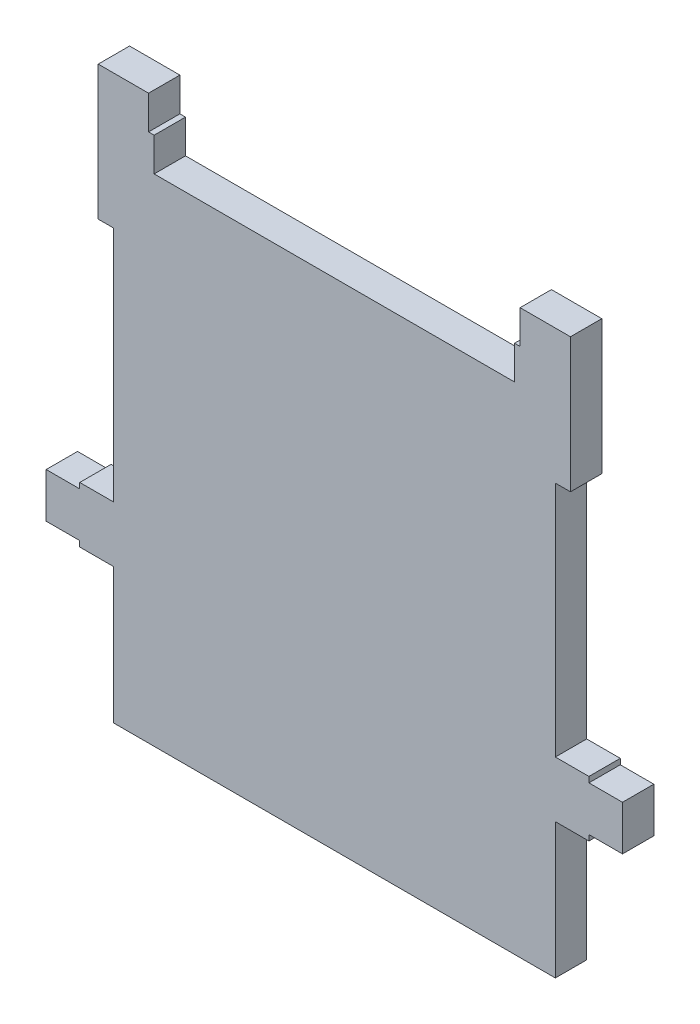
ISO-10303-21;
HEADER;
FILE_DESCRIPTION(('STEP AP214'),'2;1');
FILE_NAME('part.step','',(''),(''),'','','');
FILE_SCHEMA(('AUTOMOTIVE_DESIGN { 1 0 10303 214 1 1 1 1 }'));
ENDSEC;
DATA;
#1=APPLICATION_CONTEXT('core data for automotive mechanical design processes');
#2=APPLICATION_PROTOCOL_DEFINITION('international standard','automotive_design',2000,#1);
#3=PRODUCT_CONTEXT('',#1,'mechanical');
#4=PRODUCT('Part','Part','',(#3));
#5=PRODUCT_RELATED_PRODUCT_CATEGORY('part','',(#4));
#6=PRODUCT_DEFINITION_FORMATION('','',#4);
#7=PRODUCT_DEFINITION_CONTEXT('part definition',#1,'design');
#8=PRODUCT_DEFINITION('design','',#6,#7);
#9=PRODUCT_DEFINITION_SHAPE('','',#8);
#10=(LENGTH_UNIT() NAMED_UNIT(*) SI_UNIT(.MILLI.,.METRE.));
#11=(NAMED_UNIT(*) PLANE_ANGLE_UNIT() SI_UNIT($,.RADIAN.));
#12=(NAMED_UNIT(*) SI_UNIT($,.STERADIAN.) SOLID_ANGLE_UNIT());
#13=UNCERTAINTY_MEASURE_WITH_UNIT(LENGTH_MEASURE(1.E-05),#10,'distance_accuracy_value','');
#14=(GEOMETRIC_REPRESENTATION_CONTEXT(3) GLOBAL_UNCERTAINTY_ASSIGNED_CONTEXT((#13)) GLOBAL_UNIT_ASSIGNED_CONTEXT((#10,
#11,#12)) REPRESENTATION_CONTEXT('',''));
#15=CARTESIAN_POINT('',(0.,0.,0.));
#16=DIRECTION('',(0.,0.,1.));
#17=DIRECTION('',(1.,0.,0.));
#18=AXIS2_PLACEMENT_3D('',#15,#16,#17);
#19=CARTESIAN_POINT('',(-1.97499732,-2.51499878,0.));
#20=DIRECTION('',(0.,0.,-1.));
#21=DIRECTION('',(0.,-1.,0.));
#22=AXIS2_PLACEMENT_3D('',#19,#20,#21);
#23=PLANE('',#22);
#24=DIRECTION('',(0.,1.,0.));
#25=VECTOR('',#24,1.);
#26=CARTESIAN_POINT('',(1.97499986,-1.30499866,0.));
#27=LINE('',#26,#25);
#28=CARTESIAN_POINT('',(1.97499986,-2.51499878,0.));
#29=VERTEX_POINT('',#28);
#30=CARTESIAN_POINT('',(1.97499986,-1.30499866,0.));
#31=VERTEX_POINT('',#30);
#32=EDGE_CURVE('E282',#29,#31,#27,.T.);
#33=ORIENTED_EDGE('',*,*,#32,.F.);
#34=DIRECTION('',(1.,0.,0.));
#35=VECTOR('',#34,1.);
#36=CARTESIAN_POINT('',(1.97499986,-2.51499878,0.));
#37=LINE('',#36,#35);
#38=CARTESIAN_POINT('',(-1.97499732,-2.51499878,0.));
#39=VERTEX_POINT('',#38);
#40=EDGE_CURVE('E283',#39,#29,#37,.T.);
#41=ORIENTED_EDGE('',*,*,#40,.F.);
#42=DIRECTION('',(0.,-1.,0.));
#43=VECTOR('',#42,1.);
#44=CARTESIAN_POINT('',(-1.97499732,-2.51499878,0.));
#45=LINE('',#44,#43);
#46=CARTESIAN_POINT('',(-1.97499732,-1.30499866,0.));
#47=VERTEX_POINT('',#46);
#48=EDGE_CURVE('E11',#47,#39,#45,.T.);
#49=ORIENTED_EDGE('',*,*,#48,.F.);
#50=DIRECTION('',(1.,0.,0.));
#51=VECTOR('',#50,1.);
#52=CARTESIAN_POINT('',(-1.97499732,-1.30499866,0.));
#53=LINE('',#52,#51);
#54=CARTESIAN_POINT('',(-2.27499926,-1.30499866,0.));
#55=VERTEX_POINT('',#54);
#56=EDGE_CURVE('E20',#55,#47,#53,.T.);
#57=ORIENTED_EDGE('',*,*,#56,.F.);
#58=DIRECTION('',(0.,-1.,0.));
#59=VECTOR('',#58,1.);
#60=CARTESIAN_POINT('',(-2.27499926,-1.30499866,0.));
#61=LINE('',#60,#59);
#62=CARTESIAN_POINT('',(-2.27499926,-1.25499876,0.));
#63=VERTEX_POINT('',#62);
#64=EDGE_CURVE('E170',#63,#55,#61,.T.);
#65=ORIENTED_EDGE('',*,*,#64,.F.);
#66=DIRECTION('',(1.,0.,0.));
#67=VECTOR('',#66,1.);
#68=CARTESIAN_POINT('',(-2.27499926,-1.25499876,0.));
#69=LINE('',#68,#67);
#70=CARTESIAN_POINT('',(-2.57499866,-1.25499876,0.));
#71=VERTEX_POINT('',#70);
#72=EDGE_CURVE('E164',#71,#63,#69,.T.);
#73=ORIENTED_EDGE('',*,*,#72,.F.);
#74=DIRECTION('',(0.,-1.,0.));
#75=VECTOR('',#74,1.);
#76=CARTESIAN_POINT('',(-2.57499866,-1.25499876,0.));
#77=LINE('',#76,#75);
#78=CARTESIAN_POINT('',(-2.57499866,-0.85499956,0.));
#79=VERTEX_POINT('',#78);
#80=EDGE_CURVE('E167',#79,#71,#77,.T.);
#81=ORIENTED_EDGE('',*,*,#80,.F.);
#82=DIRECTION('',(-1.,0.,0.));
#83=VECTOR('',#82,1.);
#84=CARTESIAN_POINT('',(-2.57499866,-0.85499956,0.));
#85=LINE('',#84,#83);
#86=CARTESIAN_POINT('',(-2.27499926,-0.85499956,0.));
#87=VERTEX_POINT('',#86);
#88=EDGE_CURVE('E199',#87,#79,#85,.T.);
#89=ORIENTED_EDGE('',*,*,#88,.F.);
#90=DIRECTION('',(0.,-1.,0.));
#91=VECTOR('',#90,1.);
#92=CARTESIAN_POINT('',(-2.27499926,-0.85499956,0.));
#93=LINE('',#92,#91);
#94=CARTESIAN_POINT('',(-2.27499926,-0.80499966,0.));
#95=VERTEX_POINT('',#94);
#96=EDGE_CURVE('E245',#95,#87,#93,.T.);
#97=ORIENTED_EDGE('',*,*,#96,.F.);
#98=DIRECTION('',(-1.,0.,0.));
#99=VECTOR('',#98,1.);
#100=CARTESIAN_POINT('',(-2.27499926,-0.80499966,0.));
#101=LINE('',#100,#99);
#102=CARTESIAN_POINT('',(-1.97499732,-0.80499966,0.));
#103=VERTEX_POINT('',#102);
#104=EDGE_CURVE('E418',#103,#95,#101,.T.);
#105=ORIENTED_EDGE('',*,*,#104,.F.);
#106=DIRECTION('',(0.,-1.,0.));
#107=VECTOR('',#106,1.);
#108=CARTESIAN_POINT('',(-1.97499732,-0.80499966,0.));
#109=LINE('',#108,#107);
#110=CARTESIAN_POINT('',(-1.97499732,1.31500118,0.));
#111=VERTEX_POINT('',#110);
#112=EDGE_CURVE('E419',#111,#103,#109,.T.);
#113=ORIENTED_EDGE('',*,*,#112,.F.);
#114=DIRECTION('',(1.,0.,0.));
#115=VECTOR('',#114,1.);
#116=CARTESIAN_POINT('',(-1.97499732,1.31500118,0.));
#117=LINE('',#116,#115);
#118=CARTESIAN_POINT('',(-2.10999832,1.31500118,0.));
#119=VERTEX_POINT('',#118);
#120=EDGE_CURVE('E476',#119,#111,#117,.T.);
#121=ORIENTED_EDGE('',*,*,#120,.F.);
#122=DIRECTION('',(0.,-1.,0.));
#123=VECTOR('',#122,1.);
#124=CARTESIAN_POINT('',(-2.10999832,1.31500118,0.));
#125=LINE('',#124,#123);
#126=CARTESIAN_POINT('',(-2.10999832,2.51500132,0.));
#127=VERTEX_POINT('',#126);
#128=EDGE_CURVE('E267',#127,#119,#125,.T.);
#129=ORIENTED_EDGE('',*,*,#128,.F.);
#130=DIRECTION('',(-1.,0.,0.));
#131=VECTOR('',#130,1.);
#132=CARTESIAN_POINT('',(-2.10999832,2.51500132,0.));
#133=LINE('',#132,#131);
#134=CARTESIAN_POINT('',(-1.65999922,2.51500132,0.));
#135=VERTEX_POINT('',#134);
#136=EDGE_CURVE('E268',#135,#127,#133,.T.);
#137=ORIENTED_EDGE('',*,*,#136,.F.);
#138=DIRECTION('',(0.,1.,0.));
#139=VECTOR('',#138,1.);
#140=CARTESIAN_POINT('',(-1.65999922,2.51500132,0.));
#141=LINE('',#140,#139);
#142=CARTESIAN_POINT('',(-1.65999922,2.21500192,0.));
#143=VERTEX_POINT('',#142);
#144=EDGE_CURVE('E436',#143,#135,#141,.T.);
#145=ORIENTED_EDGE('',*,*,#144,.F.);
#146=DIRECTION('',(-1.,0.,0.));
#147=VECTOR('',#146,1.);
#148=CARTESIAN_POINT('',(-1.65999922,2.21500192,0.));
#149=LINE('',#148,#147);
#150=CARTESIAN_POINT('',(-1.60999932,2.21500192,0.));
#151=VERTEX_POINT('',#150);
#152=EDGE_CURVE('E437',#151,#143,#149,.T.);
#153=ORIENTED_EDGE('',*,*,#152,.F.);
#154=DIRECTION('',(0.,1.,0.));
#155=VECTOR('',#154,1.);
#156=CARTESIAN_POINT('',(-1.60999932,2.21500192,0.));
#157=LINE('',#156,#155);
#158=CARTESIAN_POINT('',(-1.60999932,1.91499998,0.));
#159=VERTEX_POINT('',#158);
#160=EDGE_CURVE('E420',#159,#151,#157,.T.);
#161=ORIENTED_EDGE('',*,*,#160,.F.);
#162=DIRECTION('',(-1.,0.,0.));
#163=VECTOR('',#162,1.);
#164=CARTESIAN_POINT('',(-1.60999932,1.91499998,0.));
#165=LINE('',#164,#163);
#166=CARTESIAN_POINT('',(1.61000186,1.91499998,0.));
#167=VERTEX_POINT('',#166);
#168=EDGE_CURVE('E508',#167,#159,#165,.T.);
#169=ORIENTED_EDGE('',*,*,#168,.F.);
#170=DIRECTION('',(0.,-1.,0.));
#171=VECTOR('',#170,1.);
#172=CARTESIAN_POINT('',(1.61000186,1.91499998,0.));
#173=LINE('',#172,#171);
#174=CARTESIAN_POINT('',(1.61000186,2.21500192,0.));
#175=VERTEX_POINT('',#174);
#176=EDGE_CURVE('E371',#175,#167,#173,.T.);
#177=ORIENTED_EDGE('',*,*,#176,.F.);
#178=DIRECTION('',(-1.,0.,0.));
#179=VECTOR('',#178,1.);
#180=CARTESIAN_POINT('',(1.61000186,2.21500192,0.));
#181=LINE('',#180,#179);
#182=CARTESIAN_POINT('',(1.66000176,2.21500192,0.));
#183=VERTEX_POINT('',#182);
#184=EDGE_CURVE('E231',#183,#175,#181,.T.);
#185=ORIENTED_EDGE('',*,*,#184,.F.);
#186=DIRECTION('',(0.,-1.,0.));
#187=VECTOR('',#186,1.);
#188=CARTESIAN_POINT('',(1.66000176,2.21500192,0.));
#189=LINE('',#188,#187);
#190=CARTESIAN_POINT('',(1.66000176,2.51500132,0.));
#191=VERTEX_POINT('',#190);
#192=EDGE_CURVE('E491',#191,#183,#189,.T.);
#193=ORIENTED_EDGE('',*,*,#192,.F.);
#194=DIRECTION('',(-1.,0.,0.));
#195=VECTOR('',#194,1.);
#196=CARTESIAN_POINT('',(1.66000176,2.51500132,0.));
#197=LINE('',#196,#195);
#198=CARTESIAN_POINT('',(2.11000086,2.51500132,0.));
#199=VERTEX_POINT('',#198);
#200=EDGE_CURVE('E342',#199,#191,#197,.T.);
#201=ORIENTED_EDGE('',*,*,#200,.F.);
#202=DIRECTION('',(0.,1.,0.));
#203=VECTOR('',#202,1.);
#204=CARTESIAN_POINT('',(2.11000086,2.51500132,0.));
#205=LINE('',#204,#203);
#206=CARTESIAN_POINT('',(2.11000086,1.31500118,0.));
#207=VERTEX_POINT('',#206);
#208=EDGE_CURVE('E402',#207,#199,#205,.T.);
#209=ORIENTED_EDGE('',*,*,#208,.F.);
#210=DIRECTION('',(1.,0.,0.));
#211=VECTOR('',#210,1.);
#212=CARTESIAN_POINT('',(2.11000086,1.31500118,0.));
#213=LINE('',#212,#211);
#214=CARTESIAN_POINT('',(1.97499986,1.31500118,0.));
#215=VERTEX_POINT('',#214);
#216=EDGE_CURVE('E403',#215,#207,#213,.T.);
#217=ORIENTED_EDGE('',*,*,#216,.F.);
#218=DIRECTION('',(0.,1.,0.));
#219=VECTOR('',#218,1.);
#220=CARTESIAN_POINT('',(1.97499986,1.31500118,0.));
#221=LINE('',#220,#219);
#222=CARTESIAN_POINT('',(1.97499986,-0.80499966,0.));
#223=VERTEX_POINT('',#222);
#224=EDGE_CURVE('E460',#223,#215,#221,.T.);
#225=ORIENTED_EDGE('',*,*,#224,.F.);
#226=DIRECTION('',(-1.,0.,0.));
#227=VECTOR('',#226,1.);
#228=CARTESIAN_POINT('',(1.97499986,-0.80499966,0.));
#229=LINE('',#228,#227);
#230=CARTESIAN_POINT('',(2.2750018,-0.80499966,0.));
#231=VERTEX_POINT('',#230);
#232=EDGE_CURVE('E452',#231,#223,#229,.T.);
#233=ORIENTED_EDGE('',*,*,#232,.F.);
#234=DIRECTION('',(0.,1.,0.));
#235=VECTOR('',#234,1.);
#236=CARTESIAN_POINT('',(2.2750018,-0.80499966,0.));
#237=LINE('',#236,#235);
#238=CARTESIAN_POINT('',(2.2750018,-0.85499956,0.));
#239=VERTEX_POINT('',#238);
#240=EDGE_CURVE('E444',#239,#231,#237,.T.);
#241=ORIENTED_EDGE('',*,*,#240,.F.);
#242=DIRECTION('',(-1.,0.,0.));
#243=VECTOR('',#242,1.);
#244=CARTESIAN_POINT('',(2.2750018,-0.85499956,0.));
#245=LINE('',#244,#243);
#246=CARTESIAN_POINT('',(2.5750012,-0.85499956,0.));
#247=VERTEX_POINT('',#246);
#248=EDGE_CURVE('E360',#247,#239,#245,.T.);
#249=ORIENTED_EDGE('',*,*,#248,.F.);
#250=DIRECTION('',(0.,1.,0.));
#251=VECTOR('',#250,1.);
#252=CARTESIAN_POINT('',(2.5750012,-0.85499956,0.));
#253=LINE('',#252,#251);
#254=CARTESIAN_POINT('',(2.5750012,-1.25499876,0.));
#255=VERTEX_POINT('',#254);
#256=EDGE_CURVE('E276',#255,#247,#253,.T.);
#257=ORIENTED_EDGE('',*,*,#256,.F.);
#258=DIRECTION('',(1.,0.,0.));
#259=VECTOR('',#258,1.);
#260=CARTESIAN_POINT('',(2.5750012,-1.25499876,0.));
#261=LINE('',#260,#259);
#262=CARTESIAN_POINT('',(2.2750018,-1.25499876,0.));
#263=VERTEX_POINT('',#262);
#264=EDGE_CURVE('E277',#263,#255,#261,.T.);
#265=ORIENTED_EDGE('',*,*,#264,.F.);
#266=DIRECTION('',(0.,1.,0.));
#267=VECTOR('',#266,1.);
#268=CARTESIAN_POINT('',(2.2750018,-1.25499876,0.));
#269=LINE('',#268,#267);
#270=CARTESIAN_POINT('',(2.2750018,-1.30499866,0.));
#271=VERTEX_POINT('',#270);
#272=EDGE_CURVE('E314',#271,#263,#269,.T.);
#273=ORIENTED_EDGE('',*,*,#272,.F.);
#274=DIRECTION('',(1.,0.,0.));
#275=VECTOR('',#274,1.);
#276=CARTESIAN_POINT('',(2.2750018,-1.30499866,0.));
#277=LINE('',#276,#275);
#278=EDGE_CURVE('E315',#31,#271,#277,.T.);
#279=ORIENTED_EDGE('',*,*,#278,.F.);
#280=EDGE_LOOP('',(#33,#41,#49,#57,#65,#73,#81,#89,#97,#105,#113,#121,#129,#137,#145,#153,#161,
#169,#177,#185,#193,#201,#209,#217,#225,#233,#241,#249,#257,#265,#273,#279));
#281=FACE_BOUND('',#280,.T.);
#282=ADVANCED_FACE('F17',(#281),#23,.T.);
#283=CARTESIAN_POINT('',(-1.97499732,-2.51499878,0.));
#284=DIRECTION('',(-1.,0.,0.));
#285=DIRECTION('',(0.,0.,1.));
#286=AXIS2_PLACEMENT_3D('',#283,#284,#285);
#287=PLANE('',#286);
#288=DIRECTION('',(0.,0.,1.));
#289=VECTOR('',#288,1.);
#290=CARTESIAN_POINT('',(-1.97499732,-1.30499866,0.));
#291=LINE('',#290,#289);
#292=CARTESIAN_POINT('',(-1.97499732,-1.30499866,0.27999944));
#293=VERTEX_POINT('',#292);
#294=EDGE_CURVE('E26',#47,#293,#291,.T.);
#295=ORIENTED_EDGE('',*,*,#294,.F.);
#296=ORIENTED_EDGE('',*,*,#48,.T.);
#297=DIRECTION('',(0.,0.,-1.));
#298=VECTOR('',#297,1.);
#299=CARTESIAN_POINT('',(-1.97499732,-2.51499878,0.));
#300=LINE('',#299,#298);
#301=CARTESIAN_POINT('',(-1.97499732,-2.51499878,0.27999944));
#302=VERTEX_POINT('',#301);
#303=EDGE_CURVE('E337',#302,#39,#300,.T.);
#304=ORIENTED_EDGE('',*,*,#303,.F.);
#305=DIRECTION('',(0.,1.,0.));
#306=VECTOR('',#305,1.);
#307=CARTESIAN_POINT('',(-1.97499732,-2.51499878,0.27999944));
#308=LINE('',#307,#306);
#309=EDGE_CURVE('E338',#302,#293,#308,.T.);
#310=ORIENTED_EDGE('',*,*,#309,.T.);
#311=EDGE_LOOP('',(#295,#296,#304,#310));
#312=FACE_BOUND('',#311,.T.);
#313=ADVANCED_FACE('F786',(#312),#287,.T.);
#314=CARTESIAN_POINT('',(-1.97499732,-1.30499866,0.));
#315=DIRECTION('',(0.,-1.,0.));
#316=DIRECTION('',(0.,0.,-1.));
#317=AXIS2_PLACEMENT_3D('',#314,#315,#316);
#318=PLANE('',#317);
#319=DIRECTION('',(0.,0.,1.));
#320=VECTOR('',#319,1.);
#321=CARTESIAN_POINT('',(-2.27499926,-1.30499866,0.));
#322=LINE('',#321,#320);
#323=CARTESIAN_POINT('',(-2.27499926,-1.30499866,0.27999944));
#324=VERTEX_POINT('',#323);
#325=EDGE_CURVE('E208',#55,#324,#322,.T.);
#326=ORIENTED_EDGE('',*,*,#325,.F.);
#327=ORIENTED_EDGE('',*,*,#56,.T.);
#328=ORIENTED_EDGE('',*,*,#294,.T.);
#329=DIRECTION('',(-1.,0.,0.));
#330=VECTOR('',#329,1.);
#331=CARTESIAN_POINT('',(-1.97499732,-1.30499866,0.27999944));
#332=LINE('',#331,#330);
#333=EDGE_CURVE('E381',#293,#324,#332,.T.);
#334=ORIENTED_EDGE('',*,*,#333,.T.);
#335=EDGE_LOOP('',(#326,#327,#328,#334));
#336=FACE_BOUND('',#335,.T.);
#337=ADVANCED_FACE('F797',(#336),#318,.T.);
#338=CARTESIAN_POINT('',(-2.27499926,-1.30499866,0.));
#339=DIRECTION('',(-1.,0.,0.));
#340=DIRECTION('',(0.,0.,1.));
#341=AXIS2_PLACEMENT_3D('',#338,#339,#340);
#342=PLANE('',#341);
#343=DIRECTION('',(0.,0.,1.));
#344=VECTOR('',#343,1.);
#345=CARTESIAN_POINT('',(-2.27499926,-1.25499876,0.));
#346=LINE('',#345,#344);
#347=CARTESIAN_POINT('',(-2.27499926,-1.25499876,0.27999944));
#348=VERTEX_POINT('',#347);
#349=EDGE_CURVE('E175',#63,#348,#346,.T.);
#350=ORIENTED_EDGE('',*,*,#349,.F.);
#351=ORIENTED_EDGE('',*,*,#64,.T.);
#352=ORIENTED_EDGE('',*,*,#325,.T.);
#353=DIRECTION('',(0.,1.,0.));
#354=VECTOR('',#353,1.);
#355=CARTESIAN_POINT('',(-2.27499926,-2.51499878,0.27999944));
#356=LINE('',#355,#354);
#357=EDGE_CURVE('E377',#324,#348,#356,.T.);
#358=ORIENTED_EDGE('',*,*,#357,.T.);
#359=EDGE_LOOP('',(#350,#351,#352,#358));
#360=FACE_BOUND('',#359,.T.);
#361=ADVANCED_FACE('F552',(#360),#342,.T.);
#362=CARTESIAN_POINT('',(-2.27499926,-1.25499876,0.));
#363=DIRECTION('',(0.,-1.,0.));
#364=DIRECTION('',(0.,0.,-1.));
#365=AXIS2_PLACEMENT_3D('',#362,#363,#364);
#366=PLANE('',#365);
#367=DIRECTION('',(0.,0.,1.));
#368=VECTOR('',#367,1.);
#369=CARTESIAN_POINT('',(-2.57499866,-1.25499876,0.));
#370=LINE('',#369,#368);
#371=CARTESIAN_POINT('',(-2.57499866,-1.25499876,0.27999944));
#372=VERTEX_POINT('',#371);
#373=EDGE_CURVE('E176',#71,#372,#370,.T.);
#374=ORIENTED_EDGE('',*,*,#373,.F.);
#375=ORIENTED_EDGE('',*,*,#72,.T.);
#376=ORIENTED_EDGE('',*,*,#349,.T.);
#377=DIRECTION('',(-1.,0.,0.));
#378=VECTOR('',#377,1.);
#379=CARTESIAN_POINT('',(-1.97499732,-1.25499876,0.27999944));
#380=LINE('',#379,#378);
#381=EDGE_CURVE('E183',#348,#372,#380,.T.);
#382=ORIENTED_EDGE('',*,*,#381,.T.);
#383=EDGE_LOOP('',(#374,#375,#376,#382));
#384=FACE_BOUND('',#383,.T.);
#385=ADVANCED_FACE('F180',(#384),#366,.T.);
#386=CARTESIAN_POINT('',(-2.57499866,-1.25499876,0.));
#387=DIRECTION('',(-1.,0.,0.));
#388=DIRECTION('',(0.,0.,1.));
#389=AXIS2_PLACEMENT_3D('',#386,#387,#388);
#390=PLANE('',#389);
#391=DIRECTION('',(0.,0.,1.));
#392=VECTOR('',#391,1.);
#393=CARTESIAN_POINT('',(-2.57499866,-0.85499956,0.));
#394=LINE('',#393,#392);
#395=CARTESIAN_POINT('',(-2.57499866,-0.85499956,0.27999944));
#396=VERTEX_POINT('',#395);
#397=EDGE_CURVE('E191',#79,#396,#394,.T.);
#398=ORIENTED_EDGE('',*,*,#397,.F.);
#399=ORIENTED_EDGE('',*,*,#80,.T.);
#400=ORIENTED_EDGE('',*,*,#373,.T.);
#401=DIRECTION('',(0.,1.,0.));
#402=VECTOR('',#401,1.);
#403=CARTESIAN_POINT('',(-2.57499866,-2.51499878,0.27999944));
#404=LINE('',#403,#402);
#405=EDGE_CURVE('E296',#372,#396,#404,.T.);
#406=ORIENTED_EDGE('',*,*,#405,.T.);
#407=EDGE_LOOP('',(#398,#399,#400,#406));
#408=FACE_BOUND('',#407,.T.);
#409=ADVANCED_FACE('F189',(#408),#390,.T.);
#410=CARTESIAN_POINT('',(-2.57499866,-0.85499956,0.));
#411=DIRECTION('',(0.,1.,0.));
#412=DIRECTION('',(1.,0.,0.));
#413=AXIS2_PLACEMENT_3D('',#410,#411,#412);
#414=PLANE('',#413);
#415=DIRECTION('',(0.,0.,1.));
#416=VECTOR('',#415,1.);
#417=CARTESIAN_POINT('',(-2.27499926,-0.85499956,0.));
#418=LINE('',#417,#416);
#419=CARTESIAN_POINT('',(-2.27499926,-0.85499956,0.27999944));
#420=VERTEX_POINT('',#419);
#421=EDGE_CURVE('E241',#87,#420,#418,.T.);
#422=ORIENTED_EDGE('',*,*,#421,.F.);
#423=ORIENTED_EDGE('',*,*,#88,.T.);
#424=ORIENTED_EDGE('',*,*,#397,.T.);
#425=DIRECTION('',(1.,0.,0.));
#426=VECTOR('',#425,1.);
#427=CARTESIAN_POINT('',(-1.97499732,-0.85499956,0.27999944));
#428=LINE('',#427,#426);
#429=EDGE_CURVE('E292',#396,#420,#428,.T.);
#430=ORIENTED_EDGE('',*,*,#429,.T.);
#431=EDGE_LOOP('',(#422,#423,#424,#430));
#432=FACE_BOUND('',#431,.T.);
#433=ADVANCED_FACE('F696',(#432),#414,.T.);
#434=CARTESIAN_POINT('',(-2.27499926,-0.85499956,0.));
#435=DIRECTION('',(-1.,0.,0.));
#436=DIRECTION('',(0.,0.,1.));
#437=AXIS2_PLACEMENT_3D('',#434,#435,#436);
#438=PLANE('',#437);
#439=DIRECTION('',(0.,0.,1.));
#440=VECTOR('',#439,1.);
#441=CARTESIAN_POINT('',(-2.27499926,-0.80499966,0.));
#442=LINE('',#441,#440);
#443=CARTESIAN_POINT('',(-2.27499926,-0.80499966,0.27999944));
#444=VERTEX_POINT('',#443);
#445=EDGE_CURVE('E461',#95,#444,#442,.T.);
#446=ORIENTED_EDGE('',*,*,#445,.F.);
#447=ORIENTED_EDGE('',*,*,#96,.T.);
#448=ORIENTED_EDGE('',*,*,#421,.T.);
#449=DIRECTION('',(0.,1.,0.));
#450=VECTOR('',#449,1.);
#451=CARTESIAN_POINT('',(-2.27499926,-2.51499878,0.27999944));
#452=LINE('',#451,#450);
#453=EDGE_CURVE('E297',#420,#444,#452,.T.);
#454=ORIENTED_EDGE('',*,*,#453,.T.);
#455=EDGE_LOOP('',(#446,#447,#448,#454));
#456=FACE_BOUND('',#455,.T.);
#457=ADVANCED_FACE('F691',(#456),#438,.T.);
#458=CARTESIAN_POINT('',(-2.27499926,-0.80499966,0.));
#459=DIRECTION('',(0.,1.,0.));
#460=DIRECTION('',(1.,0.,0.));
#461=AXIS2_PLACEMENT_3D('',#458,#459,#460);
#462=PLANE('',#461);
#463=DIRECTION('',(0.,0.,1.));
#464=VECTOR('',#463,1.);
#465=CARTESIAN_POINT('',(-1.97499732,-0.80499966,0.));
#466=LINE('',#465,#464);
#467=CARTESIAN_POINT('',(-1.97499732,-0.80499966,0.27999944));
#468=VERTEX_POINT('',#467);
#469=EDGE_CURVE('E414',#103,#468,#466,.T.);
#470=ORIENTED_EDGE('',*,*,#469,.F.);
#471=ORIENTED_EDGE('',*,*,#104,.T.);
#472=ORIENTED_EDGE('',*,*,#445,.T.);
#473=DIRECTION('',(1.,0.,0.));
#474=VECTOR('',#473,1.);
#475=CARTESIAN_POINT('',(-1.97499732,-0.80499966,0.27999944));
#476=LINE('',#475,#474);
#477=EDGE_CURVE('E351',#444,#468,#476,.T.);
#478=ORIENTED_EDGE('',*,*,#477,.T.);
#479=EDGE_LOOP('',(#470,#471,#472,#478));
#480=FACE_BOUND('',#479,.T.);
#481=ADVANCED_FACE('F703',(#480),#462,.T.);
#482=CARTESIAN_POINT('',(-1.97499732,-0.80499966,0.));
#483=DIRECTION('',(-1.,0.,0.));
#484=DIRECTION('',(0.,0.,1.));
#485=AXIS2_PLACEMENT_3D('',#482,#483,#484);
#486=PLANE('',#485);
#487=DIRECTION('',(0.,0.,1.));
#488=VECTOR('',#487,1.);
#489=CARTESIAN_POINT('',(-1.97499732,1.31500118,0.));
#490=LINE('',#489,#488);
#491=CARTESIAN_POINT('',(-1.97499732,1.31500118,0.27999944));
#492=VERTEX_POINT('',#491);
#493=EDGE_CURVE('E534',#111,#492,#490,.T.);
#494=ORIENTED_EDGE('',*,*,#493,.F.);
#495=ORIENTED_EDGE('',*,*,#112,.T.);
#496=ORIENTED_EDGE('',*,*,#469,.T.);
#497=DIRECTION('',(0.,1.,0.));
#498=VECTOR('',#497,1.);
#499=CARTESIAN_POINT('',(-1.97499732,-2.51499878,0.27999944));
#500=LINE('',#499,#498);
#501=EDGE_CURVE('E320',#468,#492,#500,.T.);
#502=ORIENTED_EDGE('',*,*,#501,.T.);
#503=EDGE_LOOP('',(#494,#495,#496,#502));
#504=FACE_BOUND('',#503,.T.);
#505=ADVANCED_FACE('F707',(#504),#486,.T.);
#506=CARTESIAN_POINT('',(-1.97499732,1.31500118,0.));
#507=DIRECTION('',(0.,-1.,0.));
#508=DIRECTION('',(0.,0.,-1.));
#509=AXIS2_PLACEMENT_3D('',#506,#507,#508);
#510=PLANE('',#509);
#511=DIRECTION('',(0.,0.,1.));
#512=VECTOR('',#511,1.);
#513=CARTESIAN_POINT('',(-2.10999832,1.31500118,0.));
#514=LINE('',#513,#512);
#515=CARTESIAN_POINT('',(-2.10999832,1.31500118,0.27999944));
#516=VERTEX_POINT('',#515);
#517=EDGE_CURVE('E472',#119,#516,#514,.T.);
#518=ORIENTED_EDGE('',*,*,#517,.F.);
#519=ORIENTED_EDGE('',*,*,#120,.T.);
#520=ORIENTED_EDGE('',*,*,#493,.T.);
#521=DIRECTION('',(-1.,0.,0.));
#522=VECTOR('',#521,1.);
#523=CARTESIAN_POINT('',(-1.97499732,1.31500118,0.27999944));
#524=LINE('',#523,#522);
#525=EDGE_CURVE('E316',#492,#516,#524,.T.);
#526=ORIENTED_EDGE('',*,*,#525,.T.);
#527=EDGE_LOOP('',(#518,#519,#520,#526));
#528=FACE_BOUND('',#527,.T.);
#529=ADVANCED_FACE('F709',(#528),#510,.T.);
#530=CARTESIAN_POINT('',(-2.10999832,1.31500118,0.));
#531=DIRECTION('',(-1.,0.,0.));
#532=DIRECTION('',(0.,0.,1.));
#533=AXIS2_PLACEMENT_3D('',#530,#531,#532);
#534=PLANE('',#533);
#535=DIRECTION('',(0.,0.,1.));
#536=VECTOR('',#535,1.);
#537=CARTESIAN_POINT('',(-2.10999832,2.51500132,0.));
#538=LINE('',#537,#536);
#539=CARTESIAN_POINT('',(-2.10999832,2.51500132,0.27999944));
#540=VERTEX_POINT('',#539);
#541=EDGE_CURVE('E263',#127,#540,#538,.T.);
#542=ORIENTED_EDGE('',*,*,#541,.F.);
#543=ORIENTED_EDGE('',*,*,#128,.T.);
#544=ORIENTED_EDGE('',*,*,#517,.T.);
#545=DIRECTION('',(0.,1.,0.));
#546=VECTOR('',#545,1.);
#547=CARTESIAN_POINT('',(-2.10999832,-2.51499878,0.27999944));
#548=LINE('',#547,#546);
#549=EDGE_CURVE('E321',#516,#540,#548,.T.);
#550=ORIENTED_EDGE('',*,*,#549,.T.);
#551=EDGE_LOOP('',(#542,#543,#544,#550));
#552=FACE_BOUND('',#551,.T.);
#553=ADVANCED_FACE('F713',(#552),#534,.T.);
#554=CARTESIAN_POINT('',(-2.10999832,2.51500132,0.));
#555=DIRECTION('',(0.,1.,0.));
#556=DIRECTION('',(1.,0.,0.));
#557=AXIS2_PLACEMENT_3D('',#554,#555,#556);
#558=PLANE('',#557);
#559=DIRECTION('',(0.,0.,1.));
#560=VECTOR('',#559,1.);
#561=CARTESIAN_POINT('',(-1.65999922,2.51500132,0.));
#562=LINE('',#561,#560);
#563=CARTESIAN_POINT('',(-1.65999922,2.51500132,0.27999944));
#564=VERTEX_POINT('',#563);
#565=EDGE_CURVE('E524',#135,#564,#562,.T.);
#566=ORIENTED_EDGE('',*,*,#565,.F.);
#567=ORIENTED_EDGE('',*,*,#136,.T.);
#568=ORIENTED_EDGE('',*,*,#541,.T.);
#569=DIRECTION('',(1.,0.,0.));
#570=VECTOR('',#569,1.);
#571=CARTESIAN_POINT('',(-1.97499732,2.51500132,0.27999944));
#572=LINE('',#571,#570);
#573=EDGE_CURVE('E329',#540,#564,#572,.T.);
#574=ORIENTED_EDGE('',*,*,#573,.T.);
#575=EDGE_LOOP('',(#566,#567,#568,#574));
#576=FACE_BOUND('',#575,.T.);
#577=ADVANCED_FACE('F717',(#576),#558,.T.);
#578=CARTESIAN_POINT('',(-1.65999922,2.51500132,0.));
#579=DIRECTION('',(1.,0.,0.));
#580=DIRECTION('',(0.,1.,0.));
#581=AXIS2_PLACEMENT_3D('',#578,#579,#580);
#582=PLANE('',#581);
#583=DIRECTION('',(0.,0.,1.));
#584=VECTOR('',#583,1.);
#585=CARTESIAN_POINT('',(-1.65999922,2.21500192,0.));
#586=LINE('',#585,#584);
#587=CARTESIAN_POINT('',(-1.65999922,2.21500192,0.27999944));
#588=VERTEX_POINT('',#587);
#589=EDGE_CURVE('E432',#143,#588,#586,.T.);
#590=ORIENTED_EDGE('',*,*,#589,.F.);
#591=ORIENTED_EDGE('',*,*,#144,.T.);
#592=ORIENTED_EDGE('',*,*,#565,.T.);
#593=DIRECTION('',(0.,-1.,0.));
#594=VECTOR('',#593,1.);
#595=CARTESIAN_POINT('',(-1.65999922,-2.51499878,0.27999944));
#596=LINE('',#595,#594);
#597=EDGE_CURVE('E325',#564,#588,#596,.T.);
#598=ORIENTED_EDGE('',*,*,#597,.T.);
#599=EDGE_LOOP('',(#590,#591,#592,#598));
#600=FACE_BOUND('',#599,.T.);
#601=ADVANCED_FACE('F721',(#600),#582,.T.);
#602=CARTESIAN_POINT('',(-1.65999922,2.21500192,0.));
#603=DIRECTION('',(0.,1.,0.));
#604=DIRECTION('',(1.,0.,0.));
#605=AXIS2_PLACEMENT_3D('',#602,#603,#604);
#606=PLANE('',#605);
#607=DIRECTION('',(0.,0.,1.));
#608=VECTOR('',#607,1.);
#609=CARTESIAN_POINT('',(-1.60999932,2.21500192,0.));
#610=LINE('',#609,#608);
#611=CARTESIAN_POINT('',(-1.60999932,2.21500192,0.27999944));
#612=VERTEX_POINT('',#611);
#613=EDGE_CURVE('E424',#151,#612,#610,.T.);
#614=ORIENTED_EDGE('',*,*,#613,.F.);
#615=ORIENTED_EDGE('',*,*,#152,.T.);
#616=ORIENTED_EDGE('',*,*,#589,.T.);
#617=DIRECTION('',(1.,0.,0.));
#618=VECTOR('',#617,1.);
#619=CARTESIAN_POINT('',(-1.97499732,2.21500192,0.27999944));
#620=LINE('',#619,#618);
#621=EDGE_CURVE('E309',#588,#612,#620,.T.);
#622=ORIENTED_EDGE('',*,*,#621,.T.);
#623=EDGE_LOOP('',(#614,#615,#616,#622));
#624=FACE_BOUND('',#623,.T.);
#625=ADVANCED_FACE('F725',(#624),#606,.T.);
#626=CARTESIAN_POINT('',(-1.60999932,2.21500192,0.));
#627=DIRECTION('',(1.,0.,0.));
#628=DIRECTION('',(0.,1.,0.));
#629=AXIS2_PLACEMENT_3D('',#626,#627,#628);
#630=PLANE('',#629);
#631=DIRECTION('',(0.,0.,1.));
#632=VECTOR('',#631,1.);
#633=CARTESIAN_POINT('',(-1.60999932,1.91499998,0.));
#634=LINE('',#633,#632);
#635=CARTESIAN_POINT('',(-1.60999932,1.91499998,0.27999944));
#636=VERTEX_POINT('',#635);
#637=EDGE_CURVE('E425',#159,#636,#634,.T.);
#638=ORIENTED_EDGE('',*,*,#637,.F.);
#639=ORIENTED_EDGE('',*,*,#160,.T.);
#640=ORIENTED_EDGE('',*,*,#613,.T.);
#641=DIRECTION('',(0.,-1.,0.));
#642=VECTOR('',#641,1.);
#643=CARTESIAN_POINT('',(-1.60999932,-2.51499878,0.27999944));
#644=LINE('',#643,#642);
#645=EDGE_CURVE('E305',#612,#636,#644,.T.);
#646=ORIENTED_EDGE('',*,*,#645,.T.);
#647=EDGE_LOOP('',(#638,#639,#640,#646));
#648=FACE_BOUND('',#647,.T.);
#649=ADVANCED_FACE('F729',(#648),#630,.T.);
#650=CARTESIAN_POINT('',(-1.60999932,1.91499998,0.));
#651=DIRECTION('',(0.,1.,0.));
#652=DIRECTION('',(1.,0.,0.));
#653=AXIS2_PLACEMENT_3D('',#650,#651,#652);
#654=PLANE('',#653);
#655=DIRECTION('',(0.,0.,1.));
#656=VECTOR('',#655,1.);
#657=CARTESIAN_POINT('',(1.61000186,1.91499998,0.));
#658=LINE('',#657,#656);
#659=CARTESIAN_POINT('',(1.61000186,1.91499998,0.27999944));
#660=VERTEX_POINT('',#659);
#661=EDGE_CURVE('E504',#167,#660,#658,.T.);
#662=ORIENTED_EDGE('',*,*,#661,.F.);
#663=ORIENTED_EDGE('',*,*,#168,.T.);
#664=ORIENTED_EDGE('',*,*,#637,.T.);
#665=DIRECTION('',(1.,0.,0.));
#666=VECTOR('',#665,1.);
#667=CARTESIAN_POINT('',(-1.97499732,1.91499998,0.27999944));
#668=LINE('',#667,#666);
#669=EDGE_CURVE('E300',#636,#660,#668,.T.);
#670=ORIENTED_EDGE('',*,*,#669,.T.);
#671=EDGE_LOOP('',(#662,#663,#664,#670));
#672=FACE_BOUND('',#671,.T.);
#673=ADVANCED_FACE('F733',(#672),#654,.T.);
#674=CARTESIAN_POINT('',(1.61000186,1.91499998,0.));
#675=DIRECTION('',(-1.,0.,0.));
#676=DIRECTION('',(0.,0.,1.));
#677=AXIS2_PLACEMENT_3D('',#674,#675,#676);
#678=PLANE('',#677);
#679=DIRECTION('',(0.,0.,1.));
#680=VECTOR('',#679,1.);
#681=CARTESIAN_POINT('',(1.61000186,2.21500192,0.));
#682=LINE('',#681,#680);
#683=CARTESIAN_POINT('',(1.61000186,2.21500192,0.27999944));
#684=VERTEX_POINT('',#683);
#685=EDGE_CURVE('E235',#175,#684,#682,.T.);
#686=ORIENTED_EDGE('',*,*,#685,.F.);
#687=ORIENTED_EDGE('',*,*,#176,.T.);
#688=ORIENTED_EDGE('',*,*,#661,.T.);
#689=DIRECTION('',(0.,1.,0.));
#690=VECTOR('',#689,1.);
#691=CARTESIAN_POINT('',(1.61000186,-2.51499878,0.27999944));
#692=LINE('',#691,#690);
#693=EDGE_CURVE('E288',#660,#684,#692,.T.);
#694=ORIENTED_EDGE('',*,*,#693,.T.);
#695=EDGE_LOOP('',(#686,#687,#688,#694));
#696=FACE_BOUND('',#695,.T.);
#697=ADVANCED_FACE('F737',(#696),#678,.T.);
#698=CARTESIAN_POINT('',(1.61000186,2.21500192,0.));
#699=DIRECTION('',(0.,1.,0.));
#700=DIRECTION('',(1.,0.,0.));
#701=AXIS2_PLACEMENT_3D('',#698,#699,#700);
#702=PLANE('',#701);
#703=DIRECTION('',(0.,0.,1.));
#704=VECTOR('',#703,1.);
#705=CARTESIAN_POINT('',(1.66000176,2.21500192,0.));
#706=LINE('',#705,#704);
#707=CARTESIAN_POINT('',(1.66000176,2.21500192,0.27999944));
#708=VERTEX_POINT('',#707);
#709=EDGE_CURVE('E236',#183,#708,#706,.T.);
#710=ORIENTED_EDGE('',*,*,#709,.F.);
#711=ORIENTED_EDGE('',*,*,#184,.T.);
#712=ORIENTED_EDGE('',*,*,#685,.T.);
#713=DIRECTION('',(1.,0.,0.));
#714=VECTOR('',#713,1.);
#715=CARTESIAN_POINT('',(-1.97499732,2.21500192,0.27999944));
#716=LINE('',#715,#714);
#717=EDGE_CURVE('E284',#684,#708,#716,.T.);
#718=ORIENTED_EDGE('',*,*,#717,.T.);
#719=EDGE_LOOP('',(#710,#711,#712,#718));
#720=FACE_BOUND('',#719,.T.);
#721=ADVANCED_FACE('F741',(#720),#702,.T.);
#722=CARTESIAN_POINT('',(1.66000176,2.21500192,0.));
#723=DIRECTION('',(-1.,0.,0.));
#724=DIRECTION('',(0.,0.,1.));
#725=AXIS2_PLACEMENT_3D('',#722,#723,#724);
#726=PLANE('',#725);
#727=DIRECTION('',(0.,0.,1.));
#728=VECTOR('',#727,1.);
#729=CARTESIAN_POINT('',(1.66000176,2.51500132,0.));
#730=LINE('',#729,#728);
#731=CARTESIAN_POINT('',(1.66000176,2.51500132,0.27999944));
#732=VERTEX_POINT('',#731);
#733=EDGE_CURVE('E346',#191,#732,#730,.T.);
#734=ORIENTED_EDGE('',*,*,#733,.F.);
#735=ORIENTED_EDGE('',*,*,#192,.T.);
#736=ORIENTED_EDGE('',*,*,#709,.T.);
#737=DIRECTION('',(0.,1.,0.));
#738=VECTOR('',#737,1.);
#739=CARTESIAN_POINT('',(1.66000176,-2.51499878,0.27999944));
#740=LINE('',#739,#738);
#741=EDGE_CURVE('E259',#708,#732,#740,.T.);
#742=ORIENTED_EDGE('',*,*,#741,.T.);
#743=EDGE_LOOP('',(#734,#735,#736,#742));
#744=FACE_BOUND('',#743,.T.);
#745=ADVANCED_FACE('F745',(#744),#726,.T.);
#746=CARTESIAN_POINT('',(1.66000176,2.51500132,0.));
#747=DIRECTION('',(0.,1.,0.));
#748=DIRECTION('',(1.,0.,0.));
#749=AXIS2_PLACEMENT_3D('',#746,#747,#748);
#750=PLANE('',#749);
#751=DIRECTION('',(0.,0.,1.));
#752=VECTOR('',#751,1.);
#753=CARTESIAN_POINT('',(2.11000086,2.51500132,0.));
#754=LINE('',#753,#752);
#755=CARTESIAN_POINT('',(2.11000086,2.51500132,0.27999944));
#756=VERTEX_POINT('',#755);
#757=EDGE_CURVE('E347',#199,#756,#754,.T.);
#758=ORIENTED_EDGE('',*,*,#757,.F.);
#759=ORIENTED_EDGE('',*,*,#200,.T.);
#760=ORIENTED_EDGE('',*,*,#733,.T.);
#761=DIRECTION('',(1.,0.,0.));
#762=VECTOR('',#761,1.);
#763=CARTESIAN_POINT('',(-1.97499732,2.51500132,0.27999944));
#764=LINE('',#763,#762);
#765=EDGE_CURVE('E255',#732,#756,#764,.T.);
#766=ORIENTED_EDGE('',*,*,#765,.T.);
#767=EDGE_LOOP('',(#758,#759,#760,#766));
#768=FACE_BOUND('',#767,.T.);
#769=ADVANCED_FACE('F749',(#768),#750,.T.);
#770=CARTESIAN_POINT('',(2.11000086,2.51500132,0.));
#771=DIRECTION('',(1.,0.,0.));
#772=DIRECTION('',(0.,1.,0.));
#773=AXIS2_PLACEMENT_3D('',#770,#771,#772);
#774=PLANE('',#773);
#775=DIRECTION('',(0.,0.,1.));
#776=VECTOR('',#775,1.);
#777=CARTESIAN_POINT('',(2.11000086,1.31500118,0.));
#778=LINE('',#777,#776);
#779=CARTESIAN_POINT('',(2.11000086,1.31500118,0.27999944));
#780=VERTEX_POINT('',#779);
#781=EDGE_CURVE('E398',#207,#780,#778,.T.);
#782=ORIENTED_EDGE('',*,*,#781,.F.);
#783=ORIENTED_EDGE('',*,*,#208,.T.);
#784=ORIENTED_EDGE('',*,*,#757,.T.);
#785=DIRECTION('',(0.,-1.,0.));
#786=VECTOR('',#785,1.);
#787=CARTESIAN_POINT('',(2.11000086,-2.51499878,0.27999944));
#788=LINE('',#787,#786);
#789=EDGE_CURVE('E250',#756,#780,#788,.T.);
#790=ORIENTED_EDGE('',*,*,#789,.T.);
#791=EDGE_LOOP('',(#782,#783,#784,#790));
#792=FACE_BOUND('',#791,.T.);
#793=ADVANCED_FACE('F753',(#792),#774,.T.);
#794=CARTESIAN_POINT('',(2.11000086,1.31500118,0.));
#795=DIRECTION('',(0.,-1.,0.));
#796=DIRECTION('',(0.,0.,-1.));
#797=AXIS2_PLACEMENT_3D('',#794,#795,#796);
#798=PLANE('',#797);
#799=DIRECTION('',(0.,0.,1.));
#800=VECTOR('',#799,1.);
#801=CARTESIAN_POINT('',(1.97499986,1.31500118,0.));
#802=LINE('',#801,#800);
#803=CARTESIAN_POINT('',(1.97499986,1.31500118,0.27999944));
#804=VERTEX_POINT('',#803);
#805=EDGE_CURVE('E468',#215,#804,#802,.T.);
#806=ORIENTED_EDGE('',*,*,#805,.F.);
#807=ORIENTED_EDGE('',*,*,#216,.T.);
#808=ORIENTED_EDGE('',*,*,#781,.T.);
#809=DIRECTION('',(-1.,0.,0.));
#810=VECTOR('',#809,1.);
#811=CARTESIAN_POINT('',(-1.97499732,1.31500118,0.27999944));
#812=LINE('',#811,#810);
#813=EDGE_CURVE('E246',#780,#804,#812,.T.);
#814=ORIENTED_EDGE('',*,*,#813,.T.);
#815=EDGE_LOOP('',(#806,#807,#808,#814));
#816=FACE_BOUND('',#815,.T.);
#817=ADVANCED_FACE('F757',(#816),#798,.T.);
#818=CARTESIAN_POINT('',(1.97499986,1.31500118,0.));
#819=DIRECTION('',(1.,0.,0.));
#820=DIRECTION('',(0.,1.,0.));
#821=AXIS2_PLACEMENT_3D('',#818,#819,#820);
#822=PLANE('',#821);
#823=DIRECTION('',(0.,0.,1.));
#824=VECTOR('',#823,1.);
#825=CARTESIAN_POINT('',(1.97499986,-0.80499966,0.));
#826=LINE('',#825,#824);
#827=CARTESIAN_POINT('',(1.97499986,-0.80499966,0.27999944));
#828=VERTEX_POINT('',#827);
#829=EDGE_CURVE('E456',#223,#828,#826,.T.);
#830=ORIENTED_EDGE('',*,*,#829,.F.);
#831=ORIENTED_EDGE('',*,*,#224,.T.);
#832=ORIENTED_EDGE('',*,*,#805,.T.);
#833=DIRECTION('',(0.,-1.,0.));
#834=VECTOR('',#833,1.);
#835=CARTESIAN_POINT('',(1.97499986,-2.51499878,0.27999944));
#836=LINE('',#835,#834);
#837=EDGE_CURVE('E251',#804,#828,#836,.T.);
#838=ORIENTED_EDGE('',*,*,#837,.T.);
#839=EDGE_LOOP('',(#830,#831,#832,#838));
#840=FACE_BOUND('',#839,.T.);
#841=ADVANCED_FACE('F761',(#840),#822,.T.);
#842=CARTESIAN_POINT('',(1.97499986,-0.80499966,0.));
#843=DIRECTION('',(0.,1.,0.));
#844=DIRECTION('',(1.,0.,0.));
#845=AXIS2_PLACEMENT_3D('',#842,#843,#844);
#846=PLANE('',#845);
#847=DIRECTION('',(0.,0.,1.));
#848=VECTOR('',#847,1.);
#849=CARTESIAN_POINT('',(2.2750018,-0.80499966,0.));
#850=LINE('',#849,#848);
#851=CARTESIAN_POINT('',(2.2750018,-0.80499966,0.27999944));
#852=VERTEX_POINT('',#851);
#853=EDGE_CURVE('E448',#231,#852,#850,.T.);
#854=ORIENTED_EDGE('',*,*,#853,.F.);
#855=ORIENTED_EDGE('',*,*,#232,.T.);
#856=ORIENTED_EDGE('',*,*,#829,.T.);
#857=DIRECTION('',(1.,0.,0.));
#858=VECTOR('',#857,1.);
#859=CARTESIAN_POINT('',(-1.97499732,-0.80499966,0.27999944));
#860=LINE('',#859,#858);
#861=EDGE_CURVE('E240',#828,#852,#860,.T.);
#862=ORIENTED_EDGE('',*,*,#861,.T.);
#863=EDGE_LOOP('',(#854,#855,#856,#862));
#864=FACE_BOUND('',#863,.T.);
#865=ADVANCED_FACE('F765',(#864),#846,.T.);
#866=CARTESIAN_POINT('',(2.2750018,-0.80499966,0.));
#867=DIRECTION('',(1.,0.,0.));
#868=DIRECTION('',(0.,1.,0.));
#869=AXIS2_PLACEMENT_3D('',#866,#867,#868);
#870=PLANE('',#869);
#871=DIRECTION('',(0.,0.,1.));
#872=VECTOR('',#871,1.);
#873=CARTESIAN_POINT('',(2.2750018,-0.85499956,0.));
#874=LINE('',#873,#872);
#875=CARTESIAN_POINT('',(2.2750018,-0.85499956,0.27999944));
#876=VERTEX_POINT('',#875);
#877=EDGE_CURVE('E364',#239,#876,#874,.T.);
#878=ORIENTED_EDGE('',*,*,#877,.F.);
#879=ORIENTED_EDGE('',*,*,#240,.T.);
#880=ORIENTED_EDGE('',*,*,#853,.T.);
#881=DIRECTION('',(0.,-1.,0.));
#882=VECTOR('',#881,1.);
#883=CARTESIAN_POINT('',(2.2750018,-2.51499878,0.27999944));
#884=LINE('',#883,#882);
#885=EDGE_CURVE('E206',#852,#876,#884,.T.);
#886=ORIENTED_EDGE('',*,*,#885,.T.);
#887=EDGE_LOOP('',(#878,#879,#880,#886));
#888=FACE_BOUND('',#887,.T.);
#889=ADVANCED_FACE('F769',(#888),#870,.T.);
#890=CARTESIAN_POINT('',(2.2750018,-0.85499956,0.));
#891=DIRECTION('',(0.,1.,0.));
#892=DIRECTION('',(1.,0.,0.));
#893=AXIS2_PLACEMENT_3D('',#890,#891,#892);
#894=PLANE('',#893);
#895=DIRECTION('',(0.,0.,1.));
#896=VECTOR('',#895,1.);
#897=CARTESIAN_POINT('',(2.5750012,-0.85499956,0.));
#898=LINE('',#897,#896);
#899=CARTESIAN_POINT('',(2.5750012,-0.85499956,0.27999944));
#900=VERTEX_POINT('',#899);
#901=EDGE_CURVE('E365',#247,#900,#898,.T.);
#902=ORIENTED_EDGE('',*,*,#901,.F.);
#903=ORIENTED_EDGE('',*,*,#248,.T.);
#904=ORIENTED_EDGE('',*,*,#877,.T.);
#905=DIRECTION('',(1.,0.,0.));
#906=VECTOR('',#905,1.);
#907=CARTESIAN_POINT('',(-1.97499732,-0.85499956,0.27999944));
#908=LINE('',#907,#906);
#909=EDGE_CURVE('E202',#876,#900,#908,.T.);
#910=ORIENTED_EDGE('',*,*,#909,.T.);
#911=EDGE_LOOP('',(#902,#903,#904,#910));
#912=FACE_BOUND('',#911,.T.);
#913=ADVANCED_FACE('F772',(#912),#894,.T.);
#914=CARTESIAN_POINT('',(2.5750012,-0.85499956,0.));
#915=DIRECTION('',(1.,0.,0.));
#916=DIRECTION('',(0.,1.,0.));
#917=AXIS2_PLACEMENT_3D('',#914,#915,#916);
#918=PLANE('',#917);
#919=DIRECTION('',(0.,0.,1.));
#920=VECTOR('',#919,1.);
#921=CARTESIAN_POINT('',(2.5750012,-1.25499876,0.));
#922=LINE('',#921,#920);
#923=CARTESIAN_POINT('',(2.5750012,-1.25499876,0.27999944));
#924=VERTEX_POINT('',#923);
#925=EDGE_CURVE('E272',#255,#924,#922,.T.);
#926=ORIENTED_EDGE('',*,*,#925,.F.);
#927=ORIENTED_EDGE('',*,*,#256,.T.);
#928=ORIENTED_EDGE('',*,*,#901,.T.);
#929=DIRECTION('',(0.,-1.,0.));
#930=VECTOR('',#929,1.);
#931=CARTESIAN_POINT('',(2.5750012,-2.51499878,0.27999944));
#932=LINE('',#931,#930);
#933=EDGE_CURVE('E207',#900,#924,#932,.T.);
#934=ORIENTED_EDGE('',*,*,#933,.T.);
#935=EDGE_LOOP('',(#926,#927,#928,#934));
#936=FACE_BOUND('',#935,.T.);
#937=ADVANCED_FACE('F573',(#936),#918,.T.);
#938=CARTESIAN_POINT('',(2.5750012,-1.25499876,0.));
#939=DIRECTION('',(0.,-1.,0.));
#940=DIRECTION('',(0.,0.,-1.));
#941=AXIS2_PLACEMENT_3D('',#938,#939,#940);
#942=PLANE('',#941);
#943=DIRECTION('',(0.,0.,1.));
#944=VECTOR('',#943,1.);
#945=CARTESIAN_POINT('',(2.2750018,-1.25499876,0.));
#946=LINE('',#945,#944);
#947=CARTESIAN_POINT('',(2.2750018,-1.25499876,0.27999944));
#948=VERTEX_POINT('',#947);
#949=EDGE_CURVE('E410',#263,#948,#946,.T.);
#950=ORIENTED_EDGE('',*,*,#949,.F.);
#951=ORIENTED_EDGE('',*,*,#264,.T.);
#952=ORIENTED_EDGE('',*,*,#925,.T.);
#953=DIRECTION('',(-1.,0.,0.));
#954=VECTOR('',#953,1.);
#955=CARTESIAN_POINT('',(-1.97499732,-1.25499876,0.27999944));
#956=LINE('',#955,#954);
#957=EDGE_CURVE('E216',#924,#948,#956,.T.);
#958=ORIENTED_EDGE('',*,*,#957,.T.);
#959=EDGE_LOOP('',(#950,#951,#952,#958));
#960=FACE_BOUND('',#959,.T.);
#961=ADVANCED_FACE('F578',(#960),#942,.T.);
#962=CARTESIAN_POINT('',(2.2750018,-1.25499876,0.));
#963=DIRECTION('',(1.,0.,0.));
#964=DIRECTION('',(0.,1.,0.));
#965=AXIS2_PLACEMENT_3D('',#962,#963,#964);
#966=PLANE('',#965);
#967=DIRECTION('',(0.,0.,1.));
#968=VECTOR('',#967,1.);
#969=CARTESIAN_POINT('',(2.2750018,-1.30499866,0.));
#970=LINE('',#969,#968);
#971=CARTESIAN_POINT('',(2.2750018,-1.30499866,0.27999944));
#972=VERTEX_POINT('',#971);
#973=EDGE_CURVE('E310',#271,#972,#970,.T.);
#974=ORIENTED_EDGE('',*,*,#973,.F.);
#975=ORIENTED_EDGE('',*,*,#272,.T.);
#976=ORIENTED_EDGE('',*,*,#949,.T.);
#977=DIRECTION('',(0.,-1.,0.));
#978=VECTOR('',#977,1.);
#979=CARTESIAN_POINT('',(2.2750018,-2.51499878,0.27999944));
#980=LINE('',#979,#978);
#981=EDGE_CURVE('E212',#948,#972,#980,.T.);
#982=ORIENTED_EDGE('',*,*,#981,.T.);
#983=EDGE_LOOP('',(#974,#975,#976,#982));
#984=FACE_BOUND('',#983,.T.);
#985=ADVANCED_FACE('F583',(#984),#966,.T.);
#986=CARTESIAN_POINT('',(2.2750018,-1.30499866,0.));
#987=DIRECTION('',(0.,-1.,0.));
#988=DIRECTION('',(0.,0.,-1.));
#989=AXIS2_PLACEMENT_3D('',#986,#987,#988);
#990=PLANE('',#989);
#991=DIRECTION('',(0.,0.,1.));
#992=VECTOR('',#991,1.);
#993=CARTESIAN_POINT('',(1.97499986,-1.30499866,0.));
#994=LINE('',#993,#992);
#995=CARTESIAN_POINT('',(1.97499986,-1.30499866,0.27999944));
#996=VERTEX_POINT('',#995);
#997=EDGE_CURVE('E394',#31,#996,#994,.T.);
#998=ORIENTED_EDGE('',*,*,#997,.F.);
#999=ORIENTED_EDGE('',*,*,#278,.T.);
#1000=ORIENTED_EDGE('',*,*,#973,.T.);
#1001=DIRECTION('',(-1.,0.,0.));
#1002=VECTOR('',#1001,1.);
#1003=CARTESIAN_POINT('',(-1.97499732,-1.30499866,0.27999944));
#1004=LINE('',#1003,#1002);
#1005=EDGE_CURVE('E217',#972,#996,#1004,.T.);
#1006=ORIENTED_EDGE('',*,*,#1005,.T.);
#1007=EDGE_LOOP('',(#998,#999,#1000,#1006));
#1008=FACE_BOUND('',#1007,.T.);
#1009=ADVANCED_FACE('F587',(#1008),#990,.T.);
#1010=CARTESIAN_POINT('',(1.97499986,-1.30499866,0.));
#1011=DIRECTION('',(1.,0.,0.));
#1012=DIRECTION('',(0.,1.,0.));
#1013=AXIS2_PLACEMENT_3D('',#1010,#1011,#1012);
#1014=PLANE('',#1013);
#1015=DIRECTION('',(0.,0.,1.));
#1016=VECTOR('',#1015,1.);
#1017=CARTESIAN_POINT('',(1.97499986,-2.51499878,0.));
#1018=LINE('',#1017,#1016);
#1019=CARTESIAN_POINT('',(1.97499986,-2.51499878,0.27999944));
#1020=VERTEX_POINT('',#1019);
#1021=EDGE_CURVE('E278',#29,#1020,#1018,.T.);
#1022=ORIENTED_EDGE('',*,*,#1021,.F.);
#1023=ORIENTED_EDGE('',*,*,#32,.T.);
#1024=ORIENTED_EDGE('',*,*,#997,.T.);
#1025=DIRECTION('',(0.,-1.,0.));
#1026=VECTOR('',#1025,1.);
#1027=CARTESIAN_POINT('',(1.97499986,-2.51499878,0.27999944));
#1028=LINE('',#1027,#1026);
#1029=EDGE_CURVE('E218',#996,#1020,#1028,.T.);
#1030=ORIENTED_EDGE('',*,*,#1029,.T.);
#1031=EDGE_LOOP('',(#1022,#1023,#1024,#1030));
#1032=FACE_BOUND('',#1031,.T.);
#1033=ADVANCED_FACE('F592',(#1032),#1014,.T.);
#1034=CARTESIAN_POINT('',(1.97499986,-2.51499878,0.));
#1035=DIRECTION('',(0.,-1.,0.));
#1036=DIRECTION('',(0.,0.,-1.));
#1037=AXIS2_PLACEMENT_3D('',#1034,#1035,#1036);
#1038=PLANE('',#1037);
#1039=ORIENTED_EDGE('',*,*,#303,.T.);
#1040=ORIENTED_EDGE('',*,*,#40,.T.);
#1041=ORIENTED_EDGE('',*,*,#1021,.T.);
#1042=DIRECTION('',(-1.,0.,0.));
#1043=VECTOR('',#1042,1.);
#1044=CARTESIAN_POINT('',(-1.97499732,-2.51499878,0.27999944));
#1045=LINE('',#1044,#1043);
#1046=EDGE_CURVE('E333',#1020,#302,#1045,.T.);
#1047=ORIENTED_EDGE('',*,*,#1046,.T.);
#1048=EDGE_LOOP('',(#1039,#1040,#1041,#1047));
#1049=FACE_BOUND('',#1048,.T.);
#1050=ADVANCED_FACE('F596',(#1049),#1038,.T.);
#1051=CARTESIAN_POINT('',(-1.97499732,-2.51499878,0.27999944));
#1052=DIRECTION('',(0.,0.,-1.));
#1053=DIRECTION('',(0.,-1.,0.));
#1054=AXIS2_PLACEMENT_3D('',#1051,#1052,#1053);
#1055=PLANE('',#1054);
#1056=ORIENTED_EDGE('',*,*,#1029,.F.);
#1057=ORIENTED_EDGE('',*,*,#1005,.F.);
#1058=ORIENTED_EDGE('',*,*,#981,.F.);
#1059=ORIENTED_EDGE('',*,*,#957,.F.);
#1060=ORIENTED_EDGE('',*,*,#933,.F.);
#1061=ORIENTED_EDGE('',*,*,#909,.F.);
#1062=ORIENTED_EDGE('',*,*,#885,.F.);
#1063=ORIENTED_EDGE('',*,*,#861,.F.);
#1064=ORIENTED_EDGE('',*,*,#837,.F.);
#1065=ORIENTED_EDGE('',*,*,#813,.F.);
#1066=ORIENTED_EDGE('',*,*,#789,.F.);
#1067=ORIENTED_EDGE('',*,*,#765,.F.);
#1068=ORIENTED_EDGE('',*,*,#741,.F.);
#1069=ORIENTED_EDGE('',*,*,#717,.F.);
#1070=ORIENTED_EDGE('',*,*,#693,.F.);
#1071=ORIENTED_EDGE('',*,*,#669,.F.);
#1072=ORIENTED_EDGE('',*,*,#645,.F.);
#1073=ORIENTED_EDGE('',*,*,#621,.F.);
#1074=ORIENTED_EDGE('',*,*,#597,.F.);
#1075=ORIENTED_EDGE('',*,*,#573,.F.);
#1076=ORIENTED_EDGE('',*,*,#549,.F.);
#1077=ORIENTED_EDGE('',*,*,#525,.F.);
#1078=ORIENTED_EDGE('',*,*,#501,.F.);
#1079=ORIENTED_EDGE('',*,*,#477,.F.);
#1080=ORIENTED_EDGE('',*,*,#453,.F.);
#1081=ORIENTED_EDGE('',*,*,#429,.F.);
#1082=ORIENTED_EDGE('',*,*,#405,.F.);
#1083=ORIENTED_EDGE('',*,*,#381,.F.);
#1084=ORIENTED_EDGE('',*,*,#357,.F.);
#1085=ORIENTED_EDGE('',*,*,#333,.F.);
#1086=ORIENTED_EDGE('',*,*,#309,.F.);
#1087=ORIENTED_EDGE('',*,*,#1046,.F.);
#1088=EDGE_LOOP('',(#1056,#1057,#1058,#1059,#1060,#1061,#1062,#1063,#1064,#1065,#1066,#1067,
#1068,#1069,#1070,#1071,#1072,#1073,#1074,#1075,#1076,#1077,#1078,#1079,#1080,#1081,#1082,#1083,
#1084,#1085,#1086,#1087));
#1089=FACE_BOUND('',#1088,.T.);
#1090=ADVANCED_FACE('F698',(#1089),#1055,.F.);
#1091=CLOSED_SHELL('',(#282,#313,#337,#361,#385,#409,#433,#457,#481,#505,#529,#553,#577,#601,
#625,#649,#673,#697,#721,#745,#769,#793,#817,#841,#865,#889,#913,#937,#961,#985,#1009,#1033,
#1050,#1090));
#1092=MANIFOLD_SOLID_BREP('B1',#1091);
#1093=ADVANCED_BREP_SHAPE_REPRESENTATION('',(#18,#1092),#14);
#1094=SHAPE_DEFINITION_REPRESENTATION(#9,#1093);
ENDSEC;
END-ISO-10303-21;
